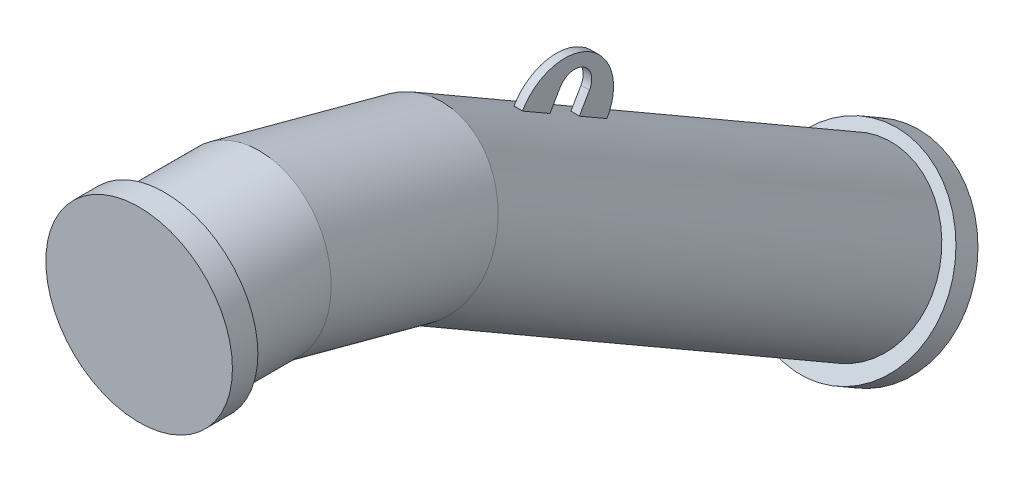
ISO-10303-21;
HEADER;
FILE_DESCRIPTION(('STEP AP214'),'2;1');
FILE_NAME('part.step','',(''),(''),'','','');
FILE_SCHEMA(('AUTOMOTIVE_DESIGN { 1 0 10303 214 1 1 1 1 }'));
ENDSEC;
DATA;
#1=APPLICATION_CONTEXT('core data for automotive mechanical design processes');
#2=APPLICATION_PROTOCOL_DEFINITION('international standard','automotive_design',2000,#1);
#3=PRODUCT_CONTEXT('',#1,'mechanical');
#4=PRODUCT('Part','Part','',(#3));
#5=PRODUCT_RELATED_PRODUCT_CATEGORY('part','',(#4));
#6=PRODUCT_DEFINITION_FORMATION('','',#4);
#7=PRODUCT_DEFINITION_CONTEXT('part definition',#1,'design');
#8=PRODUCT_DEFINITION('design','',#6,#7);
#9=PRODUCT_DEFINITION_SHAPE('','',#8);
#10=(LENGTH_UNIT() NAMED_UNIT(*) SI_UNIT(.MILLI.,.METRE.));
#11=(NAMED_UNIT(*) PLANE_ANGLE_UNIT() SI_UNIT($,.RADIAN.));
#12=(NAMED_UNIT(*) SI_UNIT($,.STERADIAN.) SOLID_ANGLE_UNIT());
#13=UNCERTAINTY_MEASURE_WITH_UNIT(LENGTH_MEASURE(1.E-05),#10,'distance_accuracy_value','');
#14=(GEOMETRIC_REPRESENTATION_CONTEXT(3) GLOBAL_UNCERTAINTY_ASSIGNED_CONTEXT((#13)) GLOBAL_UNIT_ASSIGNED_CONTEXT((#10,
#11,#12)) REPRESENTATION_CONTEXT('',''));
#15=CARTESIAN_POINT('',(0.,0.,0.));
#16=DIRECTION('',(0.,0.,1.));
#17=DIRECTION('',(1.,0.,0.));
#18=AXIS2_PLACEMENT_3D('',#15,#16,#17);
#19=CARTESIAN_POINT('',(0.,-301.111260566399,-752.501896355454));
#20=DIRECTION('',(0.,-0.500000000000001,-0.866025403784438));
#21=DIRECTION('',(-1.,0.,0.));
#22=AXIS2_PLACEMENT_3D('',#19,#20,#21);
#23=CYLINDRICAL_SURFACE('',#22,96.85);
#24=CARTESIAN_POINT('',(1.17713939678955E-13,-115.480947161672,-430.980762113534));
#25=DIRECTION('',(0.,0.500000000000001,0.866025403784438));
#26=DIRECTION('',(0.,-0.866025403784438,0.500000000000001));
#27=AXIS2_PLACEMENT_3D('',#24,#25,#26);
#28=CIRCLE('',#27,96.85);
#29=CARTESIAN_POINT('',(5.00000000000021,-31.7182354398089,-479.341186274205));
#30=VERTEX_POINT('',#29);
#31=CARTESIAN_POINT('',(-4.99999999999979,-31.7182354398089,-479.341186274205));
#32=VERTEX_POINT('',#31);
#33=EDGE_CURVE('E179',#30,#32,#28,.T.);
#34=ORIENTED_EDGE('',*,*,#33,.F.);
#35=DIRECTION('',(0.,-0.500000000000001,-0.866025403784438));
#36=VECTOR('',#35,1.);
#37=CARTESIAN_POINT('',(5.0000000000001,-217.348548844536,-800.862320516125));
#38=LINE('',#37,#36);
#39=CARTESIAN_POINT('',(5.00000000000024,-12.9682354398087,-446.865233632288));
#40=VERTEX_POINT('',#39);
#41=EDGE_CURVE('E175',#30,#40,#38,.F.);
#42=ORIENTED_EDGE('',*,*,#41,.T.);
#43=CARTESIAN_POINT('',(1.27211550709929E-13,-96.7309471616721,-398.504809471617));
#44=DIRECTION('',(0.,-0.500000000000001,-0.866025403784438));
#45=DIRECTION('',(0.,0.866025403784438,-0.500000000000001));
#46=AXIS2_PLACEMENT_3D('',#43,#44,#45);
#47=CIRCLE('',#46,96.85);
#48=CARTESIAN_POINT('',(-4.99999999999976,-12.9682354398087,-446.865233632288));
#49=VERTEX_POINT('',#48);
#50=EDGE_CURVE('E168',#49,#40,#47,.T.);
#51=ORIENTED_EDGE('',*,*,#50,.F.);
#52=DIRECTION('',(0.,-0.500000000000001,-0.866025403784438));
#53=VECTOR('',#52,1.);
#54=CARTESIAN_POINT('',(-4.9999999999999,-217.348548844536,-800.862320516125));
#55=LINE('',#54,#53);
#56=EDGE_CURVE('E172',#32,#49,#55,.F.);
#57=ORIENTED_EDGE('',*,*,#56,.F.);
#58=EDGE_LOOP('',(#34,#42,#51,#57));
#59=FACE_BOUND('',#58,.T.);
#60=CARTESIAN_POINT('',(0.,-350.480947161673,-838.012701892219));
#61=DIRECTION('',(0.,0.500000000000001,0.866025403784438));
#62=DIRECTION('',(1.,0.,0.));
#63=AXIS2_PLACEMENT_3D('',#60,#61,#62);
#64=CIRCLE('',#63,96.85);
#65=CARTESIAN_POINT('',(96.85,-350.480947161673,-838.012701892219));
#66=VERTEX_POINT('',#65);
#67=EDGE_CURVE('E149',#66,#66,#64,.T.);
#68=ORIENTED_EDGE('',*,*,#67,.T.);
#69=EDGE_LOOP('',(#68));
#70=FACE_BOUND('',#69,.T.);
#71=CARTESIAN_POINT('',(0.,-51.1112605663978,-319.489194463235));
#72=DIRECTION('',(0.,-0.382683432365091,-0.923879532511286));
#73=DIRECTION('',(0.,-0.923879532511286,0.382683432365091));
#74=AXIS2_PLACEMENT_3D('',#71,#72,#73);
#75=ELLIPSE('',#74,97.6857148321878,96.85);
#76=CARTESIAN_POINT('',(0.,-141.36109311859,-282.106489818216));
#77=VERTEX_POINT('',#76);
#78=EDGE_CURVE('E157',#77,#77,#75,.T.);
#79=ORIENTED_EDGE('',*,*,#78,.T.);
#80=EDGE_LOOP('',(#79));
#81=FACE_BOUND('',#80,.T.);
#82=CARTESIAN_POINT('',(1.07583154579251E-13,-135.480947161672,-465.621778264911));
#83=DIRECTION('',(0.,-0.500000000000001,-0.866025403784438));
#84=DIRECTION('',(0.,0.866025403784438,-0.500000000000001));
#85=AXIS2_PLACEMENT_3D('',#82,#83,#84);
#86=CIRCLE('',#85,96.85);
#87=CARTESIAN_POINT('',(-4.9999999999998,-51.7182354398089,-513.982202425582));
#88=VERTEX_POINT('',#87);
#89=CARTESIAN_POINT('',(5.0000000000002,-51.7182354398089,-513.982202425582));
#90=VERTEX_POINT('',#89);
#91=EDGE_CURVE('E10',#88,#90,#86,.T.);
#92=ORIENTED_EDGE('',*,*,#91,.F.);
#93=CARTESIAN_POINT('',(-4.9999999999998,-70.4682354398089,-546.458155067498));
#94=VERTEX_POINT('',#93);
#95=EDGE_CURVE('E176',#94,#88,#55,.F.);
#96=ORIENTED_EDGE('',*,*,#95,.F.);
#97=CARTESIAN_POINT('',(0.,-154.230947161672,-498.097730906827));
#98=DIRECTION('',(0.,0.500000000000001,0.866025403784438));
#99=DIRECTION('',(0.,-0.866025403784438,0.500000000000001));
#100=AXIS2_PLACEMENT_3D('',#97,#98,#99);
#101=CIRCLE('',#100,96.85);
#102=CARTESIAN_POINT('',(5.0000000000002,-70.4682354398089,-546.458155067498));
#103=VERTEX_POINT('',#102);
#104=EDGE_CURVE('E104',#103,#94,#101,.T.);
#105=ORIENTED_EDGE('',*,*,#104,.F.);
#106=EDGE_CURVE('E25',#103,#90,#38,.F.);
#107=ORIENTED_EDGE('',*,*,#106,.T.);
#108=EDGE_LOOP('',(#92,#96,#105,#107));
#109=FACE_BOUND('',#108,.T.);
#110=ADVANCED_FACE('F16',(#59,#70,#81,#109),#23,.T.);
#111=CARTESIAN_POINT('',(-2.38632852256486E-13,-350.480947161672,-838.01270189222));
#112=DIRECTION('',(0.,-0.5,-0.866025403784439));
#113=DIRECTION('',(1.,0.,0.));
#114=AXIS2_PLACEMENT_3D('',#111,#112,#113);
#115=PLANE('',#114);
#116=ORIENTED_EDGE('',*,*,#67,.F.);
#117=EDGE_LOOP('',(#116));
#118=FACE_BOUND('',#117,.T.);
#119=CARTESIAN_POINT('',(-2.3660102564189E-13,-353.219366733314,-836.431674615378));
#120=DIRECTION('',(0.,-0.5,-0.866025403784439));
#121=DIRECTION('',(0.,0.866025403784438,-0.5));
#122=AXIS2_PLACEMENT_3D('',#119,#120,#121);
#123=CIRCLE('',#122,113.162054553683);
#124=CARTESIAN_POINT('',(-2.3660102564189E-13,-255.218152745384,-893.01270189222));
#125=VERTEX_POINT('',#124);
#126=EDGE_CURVE('E197',#125,#125,#123,.F.);
#127=ORIENTED_EDGE('',*,*,#126,.T.);
#128=EDGE_LOOP('',(#127));
#129=FACE_BOUND('',#128,.T.);
#130=ADVANCED_FACE('F319',(#118,#129),#115,.F.);
#131=CARTESIAN_POINT('',(0.,0.,-30.));
#132=DIRECTION('',(0.,0.,1.));
#133=DIRECTION('',(1.,0.,0.));
#134=AXIS2_PLACEMENT_3D('',#131,#132,#133);
#135=CYLINDRICAL_SURFACE('',#134,110.);
#136=CARTESIAN_POINT('',(0.,0.,-30.));
#137=DIRECTION('',(0.,0.,1.));
#138=DIRECTION('',(1.,0.,0.));
#139=AXIS2_PLACEMENT_3D('',#136,#137,#138);
#140=CIRCLE('',#139,110.);
#141=CARTESIAN_POINT('',(110.,0.,-30.));
#142=VERTEX_POINT('',#141);
#143=EDGE_CURVE('E145',#142,#142,#140,.T.);
#144=ORIENTED_EDGE('',*,*,#143,.T.);
#145=EDGE_LOOP('',(#144));
#146=FACE_BOUND('',#145,.T.);
#147=CARTESIAN_POINT('',(0.,0.,0.));
#148=DIRECTION('',(0.,0.,1.));
#149=DIRECTION('',(1.,0.,0.));
#150=AXIS2_PLACEMENT_3D('',#147,#148,#149);
#151=CIRCLE('',#150,110.);
#152=CARTESIAN_POINT('',(110.,0.,0.));
#153=VERTEX_POINT('',#152);
#154=EDGE_CURVE('E144',#153,#153,#151,.T.);
#155=ORIENTED_EDGE('',*,*,#154,.F.);
#156=EDGE_LOOP('',(#155));
#157=FACE_BOUND('',#156,.T.);
#158=ADVANCED_FACE('F321',(#146,#157),#135,.T.);
#159=CARTESIAN_POINT('',(0.,0.,-30.));
#160=DIRECTION('',(0.,0.,1.));
#161=DIRECTION('',(1.,0.,0.));
#162=AXIS2_PLACEMENT_3D('',#159,#160,#161);
#163=PLANE('',#162);
#164=CARTESIAN_POINT('',(0.,0.,-30.));
#165=DIRECTION('',(0.,0.,-1.));
#166=DIRECTION('',(-1.,0.,0.));
#167=AXIS2_PLACEMENT_3D('',#164,#165,#166);
#168=CIRCLE('',#167,96.85);
#169=CARTESIAN_POINT('',(-96.85,0.,-30.));
#170=VERTEX_POINT('',#169);
#171=EDGE_CURVE('E156',#170,#170,#168,.T.);
#172=ORIENTED_EDGE('',*,*,#171,.F.);
#173=EDGE_LOOP('',(#172));
#174=FACE_BOUND('',#173,.T.);
#175=ORIENTED_EDGE('',*,*,#143,.F.);
#176=EDGE_LOOP('',(#175));
#177=FACE_BOUND('',#176,.T.);
#178=ADVANCED_FACE('F329',(#174,#177),#163,.F.);
#179=CARTESIAN_POINT('',(0.,0.,-128.739373190547));
#180=DIRECTION('',(0.,0.,1.));
#181=DIRECTION('',(1.,0.,0.));
#182=AXIS2_PLACEMENT_3D('',#179,#180,#181);
#183=CYLINDRICAL_SURFACE('',#182,96.85);
#184=ORIENTED_EDGE('',*,*,#171,.T.);
#185=EDGE_LOOP('',(#184));
#186=FACE_BOUND('',#185,.T.);
#187=CARTESIAN_POINT('',(0.,0.,-128.739373190547));
#188=DIRECTION('',(0.,-0.130526192220051,-0.99144486137381));
#189=DIRECTION('',(0.,-0.991444861373811,0.130526192220052));
#190=AXIS2_PLACEMENT_3D('',#187,#188,#189);
#191=ELLIPSE('',#190,97.6857148321878,96.85);
#192=CARTESIAN_POINT('',(0.,-96.85,-115.988828799208));
#193=VERTEX_POINT('',#192);
#194=EDGE_CURVE('E161',#193,#193,#191,.T.);
#195=ORIENTED_EDGE('',*,*,#194,.F.);
#196=EDGE_LOOP('',(#195));
#197=FACE_BOUND('',#196,.T.);
#198=ADVANCED_FACE('F18',(#186,#197),#183,.T.);
#199=CARTESIAN_POINT('',(0.,-51.1112605663978,-319.489194463235));
#200=DIRECTION('',(0.,0.258819045102521,0.965925826289068));
#201=DIRECTION('',(0.,-0.965925826289068,0.258819045102521));
#202=AXIS2_PLACEMENT_3D('',#199,#200,#201);
#203=CYLINDRICAL_SURFACE('',#202,96.85);
#204=ORIENTED_EDGE('',*,*,#78,.F.);
#205=EDGE_LOOP('',(#204));
#206=FACE_BOUND('',#205,.T.);
#207=ORIENTED_EDGE('',*,*,#194,.T.);
#208=EDGE_LOOP('',(#207));
#209=FACE_BOUND('',#208,.T.);
#210=ADVANCED_FACE('F340',(#206,#209),#203,.T.);
#211=CARTESIAN_POINT('',(5.00000000000022,-21.1248860056465,-508.551270189223));
#212=DIRECTION('',(1.,0.,0.));
#213=DIRECTION('',(0.,0.866025403784438,-0.500000000000001));
#214=AXIS2_PLACEMENT_3D('',#211,#212,#213);
#215=PLANE('',#214);
#216=ORIENTED_EDGE('',*,*,#106,.F.);
#217=DIRECTION('',(0.,0.866025403784438,-0.500000000000001));
#218=VECTOR('',#217,1.);
#219=CARTESIAN_POINT('',(5.0000000000002,-78.8867370324253,-541.597730906828));
#220=LINE('',#219,#218);
#221=CARTESIAN_POINT('',(5.0000000000002,-70.226482994581,-546.597730906828));
#222=VERTEX_POINT('',#221);
#223=EDGE_CURVE('E108',#103,#222,#220,.T.);
#224=ORIENTED_EDGE('',*,*,#223,.T.);
#225=CARTESIAN_POINT('',(5.00000000000022,-41.4764829945808,-496.801270189223));
#226=DIRECTION('',(1.,0.,0.));
#227=DIRECTION('',(0.,0.866025403784438,-0.500000000000001));
#228=AXIS2_PLACEMENT_3D('',#225,#226,#227);
#229=CIRCLE('',#228,57.5);
#230=CARTESIAN_POINT('',(5.00000000000024,-12.7264829945808,-447.004809471618));
#231=VERTEX_POINT('',#230);
#232=EDGE_CURVE('E126',#222,#231,#229,.T.);
#233=ORIENTED_EDGE('',*,*,#232,.T.);
#234=DIRECTION('',(0.,0.866025403784438,-0.500000000000001));
#235=VECTOR('',#234,1.);
#236=CARTESIAN_POINT('',(5.00000000000024,-21.3867370324252,-442.004809471618));
#237=LINE('',#236,#235);
#238=EDGE_CURVE('E199',#40,#231,#237,.T.);
#239=ORIENTED_EDGE('',*,*,#238,.F.);
#240=ORIENTED_EDGE('',*,*,#41,.F.);
#241=DIRECTION('',(0.,0.866025403784438,-0.500000000000001));
#242=VECTOR('',#241,1.);
#243=CARTESIAN_POINT('',(5.00000000000023,-31.4764829945809,-479.480762113534));
#244=LINE('',#243,#242);
#245=CARTESIAN_POINT('',(5.00000000000023,-11.1248860056465,-491.230762113534));
#246=VERTEX_POINT('',#245);
#247=EDGE_CURVE('E120',#30,#246,#244,.T.);
#248=ORIENTED_EDGE('',*,*,#247,.T.);
#249=CARTESIAN_POINT('',(5.00000000000022,-21.1248860056465,-508.551270189223));
#250=DIRECTION('',(-1.,0.,0.));
#251=DIRECTION('',(0.,0.866025403784438,-0.500000000000001));
#252=AXIS2_PLACEMENT_3D('',#249,#250,#251);
#253=CIRCLE('',#252,20.);
#254=CARTESIAN_POINT('',(5.00000000000021,-31.1248860056466,-525.871778264912));
#255=VERTEX_POINT('',#254);
#256=EDGE_CURVE('E221',#246,#255,#253,.T.);
#257=ORIENTED_EDGE('',*,*,#256,.T.);
#258=DIRECTION('',(0.,-0.866025403784438,0.500000000000001));
#259=VECTOR('',#258,1.);
#260=CARTESIAN_POINT('',(5.00000000000021,-51.4764829945809,-514.121778264912));
#261=LINE('',#260,#259);
#262=EDGE_CURVE('E216',#255,#90,#261,.T.);
#263=ORIENTED_EDGE('',*,*,#262,.T.);
#264=EDGE_LOOP('',(#216,#224,#233,#239,#240,#248,#257,#263));
#265=FACE_BOUND('',#264,.T.);
#266=ADVANCED_FACE('F342',(#265),#215,.T.);
#267=CARTESIAN_POINT('',(-4.99999999999978,-21.1248860056465,-508.551270189223));
#268=DIRECTION('',(1.,0.,0.));
#269=DIRECTION('',(0.,0.866025403784438,-0.500000000000001));
#270=AXIS2_PLACEMENT_3D('',#267,#268,#269);
#271=PLANE('',#270);
#272=DIRECTION('',(0.,0.866025403784438,-0.500000000000001));
#273=VECTOR('',#272,1.);
#274=CARTESIAN_POINT('',(-4.9999999999998,-78.8867370324253,-541.597730906828));
#275=LINE('',#274,#273);
#276=CARTESIAN_POINT('',(-4.9999999999998,-70.2264829945809,-546.597730906828));
#277=VERTEX_POINT('',#276);
#278=EDGE_CURVE('E98',#94,#277,#275,.T.);
#279=ORIENTED_EDGE('',*,*,#278,.F.);
#280=ORIENTED_EDGE('',*,*,#95,.T.);
#281=DIRECTION('',(0.,-0.866025403784438,0.500000000000001));
#282=VECTOR('',#281,1.);
#283=CARTESIAN_POINT('',(-4.99999999999979,-51.4764829945809,-514.121778264912));
#284=LINE('',#283,#282);
#285=CARTESIAN_POINT('',(-4.99999999999979,-31.1248860056466,-525.871778264912));
#286=VERTEX_POINT('',#285);
#287=EDGE_CURVE('E121',#286,#88,#284,.T.);
#288=ORIENTED_EDGE('',*,*,#287,.F.);
#289=CARTESIAN_POINT('',(-4.99999999999978,-21.1248860056465,-508.551270189223));
#290=DIRECTION('',(-1.,0.,0.));
#291=DIRECTION('',(0.,0.866025403784438,-0.500000000000001));
#292=AXIS2_PLACEMENT_3D('',#289,#290,#291);
#293=CIRCLE('',#292,20.);
#294=CARTESIAN_POINT('',(-4.99999999999978,-11.1248860056465,-491.230762113534));
#295=VERTEX_POINT('',#294);
#296=EDGE_CURVE('E251',#295,#286,#293,.T.);
#297=ORIENTED_EDGE('',*,*,#296,.F.);
#298=DIRECTION('',(0.,0.866025403784438,-0.500000000000001));
#299=VECTOR('',#298,1.);
#300=CARTESIAN_POINT('',(-4.99999999999978,-31.4764829945809,-479.480762113534));
#301=LINE('',#300,#299);
#302=EDGE_CURVE('E107',#32,#295,#301,.T.);
#303=ORIENTED_EDGE('',*,*,#302,.F.);
#304=ORIENTED_EDGE('',*,*,#56,.T.);
#305=DIRECTION('',(0.,0.866025403784438,-0.500000000000001));
#306=VECTOR('',#305,1.);
#307=CARTESIAN_POINT('',(-4.99999999999976,-21.3867370324252,-442.004809471618));
#308=LINE('',#307,#306);
#309=CARTESIAN_POINT('',(-4.99999999999976,-12.7264829945808,-447.004809471618));
#310=VERTEX_POINT('',#309);
#311=EDGE_CURVE('E115',#49,#310,#308,.T.);
#312=ORIENTED_EDGE('',*,*,#311,.T.);
#313=CARTESIAN_POINT('',(-4.99999999999978,-41.4764829945808,-496.801270189223));
#314=DIRECTION('',(1.,0.,0.));
#315=DIRECTION('',(0.,0.866025403784438,-0.500000000000001));
#316=AXIS2_PLACEMENT_3D('',#313,#314,#315);
#317=CIRCLE('',#316,57.5);
#318=EDGE_CURVE('E111',#277,#310,#317,.T.);
#319=ORIENTED_EDGE('',*,*,#318,.F.);
#320=EDGE_LOOP('',(#279,#280,#288,#297,#303,#304,#312,#319));
#321=FACE_BOUND('',#320,.T.);
#322=ADVANCED_FACE('F112',(#321),#271,.F.);
#323=CARTESIAN_POINT('',(5.00000000000023,-31.4764829945809,-479.480762113534));
#324=DIRECTION('',(0.,0.500000000000001,0.866025403784438));
#325=DIRECTION('',(0.,-0.866025403784438,0.500000000000001));
#326=AXIS2_PLACEMENT_3D('',#323,#324,#325);
#327=PLANE('',#326);
#328=ORIENTED_EDGE('',*,*,#247,.F.);
#329=ORIENTED_EDGE('',*,*,#33,.T.);
#330=ORIENTED_EDGE('',*,*,#302,.T.);
#331=DIRECTION('',(-1.,0.,0.));
#332=VECTOR('',#331,1.);
#333=CARTESIAN_POINT('',(5.00000000000023,-11.1248860056465,-491.230762113534));
#334=LINE('',#333,#332);
#335=EDGE_CURVE('E136',#246,#295,#334,.T.);
#336=ORIENTED_EDGE('',*,*,#335,.F.);
#337=EDGE_LOOP('',(#328,#329,#330,#336));
#338=FACE_BOUND('',#337,.T.);
#339=ADVANCED_FACE('F375',(#338),#327,.F.);
#340=CARTESIAN_POINT('',(5.00000000000022,-21.1248860056465,-508.551270189223));
#341=DIRECTION('',(-1.,0.,0.));
#342=DIRECTION('',(0.,-0.866025403784438,0.500000000000001));
#343=AXIS2_PLACEMENT_3D('',#340,#341,#342);
#344=CYLINDRICAL_SURFACE('',#343,20.);
#345=ORIENTED_EDGE('',*,*,#296,.T.);
#346=DIRECTION('',(-1.,0.,0.));
#347=VECTOR('',#346,1.);
#348=CARTESIAN_POINT('',(5.00000000000021,-31.1248860056466,-525.871778264912));
#349=LINE('',#348,#347);
#350=EDGE_CURVE('E128',#255,#286,#349,.T.);
#351=ORIENTED_EDGE('',*,*,#350,.F.);
#352=ORIENTED_EDGE('',*,*,#256,.F.);
#353=ORIENTED_EDGE('',*,*,#335,.T.);
#354=EDGE_LOOP('',(#345,#351,#352,#353));
#355=FACE_BOUND('',#354,.T.);
#356=ADVANCED_FACE('F378',(#355),#344,.F.);
#357=CARTESIAN_POINT('',(5.00000000000021,-51.4764829945809,-514.121778264912));
#358=DIRECTION('',(0.,-0.500000000000001,-0.866025403784438));
#359=DIRECTION('',(0.,0.866025403784438,-0.500000000000001));
#360=AXIS2_PLACEMENT_3D('',#357,#358,#359);
#361=PLANE('',#360);
#362=ORIENTED_EDGE('',*,*,#287,.T.);
#363=ORIENTED_EDGE('',*,*,#91,.T.);
#364=ORIENTED_EDGE('',*,*,#262,.F.);
#365=ORIENTED_EDGE('',*,*,#350,.T.);
#366=EDGE_LOOP('',(#362,#363,#364,#365));
#367=FACE_BOUND('',#366,.T.);
#368=ADVANCED_FACE('F382',(#367),#361,.F.);
#369=CARTESIAN_POINT('',(5.00000000000022,-41.4764829945808,-496.801270189223));
#370=DIRECTION('',(-1.,0.,0.));
#371=DIRECTION('',(0.,-0.866025403784438,0.500000000000001));
#372=AXIS2_PLACEMENT_3D('',#369,#370,#371);
#373=CYLINDRICAL_SURFACE('',#372,57.5);
#374=ORIENTED_EDGE('',*,*,#318,.T.);
#375=DIRECTION('',(-1.,0.,0.));
#376=VECTOR('',#375,1.);
#377=CARTESIAN_POINT('',(5.00000000000024,-12.7264829945808,-447.004809471618));
#378=LINE('',#377,#376);
#379=EDGE_CURVE('E129',#231,#310,#378,.T.);
#380=ORIENTED_EDGE('',*,*,#379,.F.);
#381=ORIENTED_EDGE('',*,*,#232,.F.);
#382=DIRECTION('',(-1.,0.,0.));
#383=VECTOR('',#382,1.);
#384=CARTESIAN_POINT('',(5.0000000000002,-70.226482994581,-546.597730906828));
#385=LINE('',#384,#383);
#386=EDGE_CURVE('E103',#222,#277,#385,.T.);
#387=ORIENTED_EDGE('',*,*,#386,.T.);
#388=EDGE_LOOP('',(#374,#380,#381,#387));
#389=FACE_BOUND('',#388,.T.);
#390=ADVANCED_FACE('F124',(#389),#373,.T.);
#391=CARTESIAN_POINT('',(-4.9999999999998,-78.8867370324253,-541.597730906828));
#392=DIRECTION('',(0.,0.500000000000001,0.866025403784438));
#393=DIRECTION('',(0.,-0.866025403784438,0.500000000000001));
#394=AXIS2_PLACEMENT_3D('',#391,#392,#393);
#395=PLANE('',#394);
#396=ORIENTED_EDGE('',*,*,#223,.F.);
#397=ORIENTED_EDGE('',*,*,#104,.T.);
#398=ORIENTED_EDGE('',*,*,#278,.T.);
#399=ORIENTED_EDGE('',*,*,#386,.F.);
#400=EDGE_LOOP('',(#396,#397,#398,#399));
#401=FACE_BOUND('',#400,.T.);
#402=ADVANCED_FACE('F101',(#401),#395,.F.);
#403=CARTESIAN_POINT('',(5.00000000000024,-21.3867370324252,-442.004809471618));
#404=DIRECTION('',(0.,-0.500000000000001,-0.866025403784438));
#405=DIRECTION('',(0.,0.866025403784438,-0.500000000000001));
#406=AXIS2_PLACEMENT_3D('',#403,#404,#405);
#407=PLANE('',#406);
#408=ORIENTED_EDGE('',*,*,#311,.F.);
#409=ORIENTED_EDGE('',*,*,#50,.T.);
#410=ORIENTED_EDGE('',*,*,#238,.T.);
#411=ORIENTED_EDGE('',*,*,#379,.T.);
#412=EDGE_LOOP('',(#408,#409,#410,#411));
#413=FACE_BOUND('',#412,.T.);
#414=ADVANCED_FACE('F315',(#413),#407,.F.);
#415=CARTESIAN_POINT('',(-1.52549244249158E-13,-193.184054437491,-559.242382713862));
#416=DIRECTION('',(0.,-0.5,-0.866025403784438));
#417=DIRECTION('',(0.,0.866025403784439,-0.5));
#418=AXIS2_PLACEMENT_3D('',#415,#416,#417);
#419=CYLINDRICAL_SURFACE('',#418,113.162054553683);
#420=CARTESIAN_POINT('',(-2.44479141432738E-13,-368.219366733314,-862.412436728911));
#421=DIRECTION('',(0.,-0.5,-0.866025403784439));
#422=DIRECTION('',(0.,0.866025403784438,-0.5));
#423=AXIS2_PLACEMENT_3D('',#420,#421,#422);
#424=CIRCLE('',#423,113.162054553683);
#425=CARTESIAN_POINT('',(-2.44479141432738E-13,-270.218152745384,-918.993464005753));
#426=VERTEX_POINT('',#425);
#427=EDGE_CURVE('E200',#426,#426,#424,.T.);
#428=ORIENTED_EDGE('',*,*,#427,.F.);
#429=EDGE_LOOP('',(#428));
#430=FACE_BOUND('',#429,.T.);
#431=ORIENTED_EDGE('',*,*,#126,.F.);
#432=EDGE_LOOP('',(#431));
#433=FACE_BOUND('',#432,.T.);
#434=ADVANCED_FACE('F312',(#430,#433),#419,.T.);
#435=CARTESIAN_POINT('',(-2.46510968047334E-13,-365.480947161672,-863.993464005753));
#436=DIRECTION('',(0.,-0.5,-0.866025403784439));
#437=DIRECTION('',(1.,0.,0.));
#438=AXIS2_PLACEMENT_3D('',#435,#436,#437);
#439=PLANE('',#438);
#440=ORIENTED_EDGE('',*,*,#427,.T.);
#441=EDGE_LOOP('',(#440));
#442=FACE_BOUND('',#441,.T.);
#443=ADVANCED_FACE('F310',(#442),#439,.T.);
#444=CARTESIAN_POINT('',(0.,0.,0.));
#445=DIRECTION('',(0.,0.,1.));
#446=DIRECTION('',(1.,0.,0.));
#447=AXIS2_PLACEMENT_3D('',#444,#445,#446);
#448=PLANE('',#447);
#449=ORIENTED_EDGE('',*,*,#154,.T.);
#450=EDGE_LOOP('',(#449));
#451=FACE_BOUND('',#450,.T.);
#452=ADVANCED_FACE('F339',(#451),#448,.T.);
#453=CLOSED_SHELL('',(#110,#130,#158,#178,#198,#210,#266,#322,#339,#356,#368,#390,#402,#414,
#434,#443,#452));
#454=MANIFOLD_SOLID_BREP('B1',#453);
#455=ADVANCED_BREP_SHAPE_REPRESENTATION('',(#18,#454),#14);
#456=SHAPE_DEFINITION_REPRESENTATION(#9,#455);
ENDSEC;
END-ISO-10303-21;
